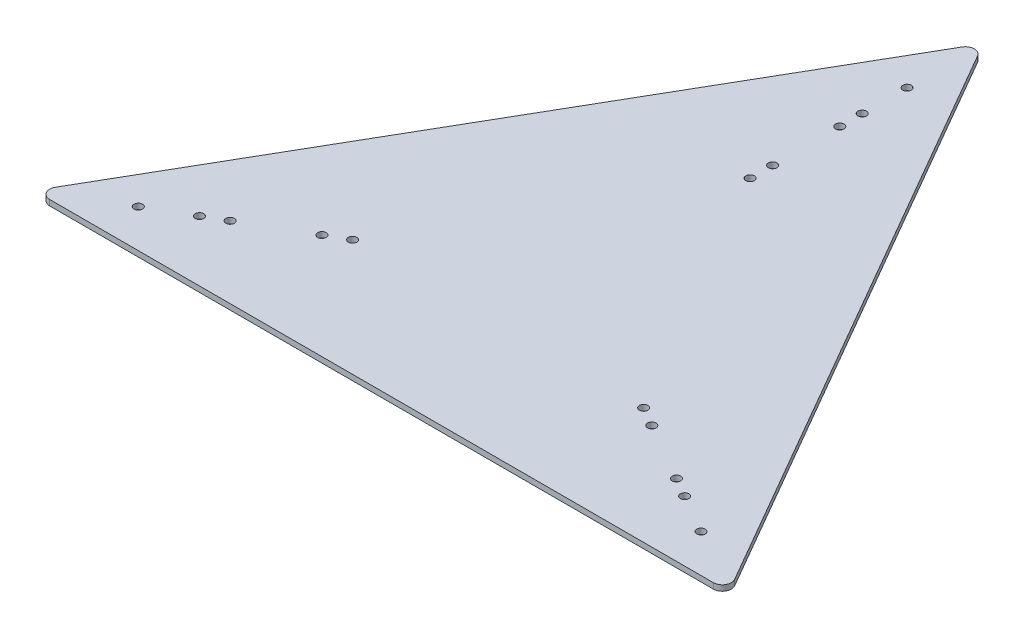
ISO-10303-21;
HEADER;
FILE_DESCRIPTION(('STEP AP214'),'2;1');
FILE_NAME('part.step','',(''),(''),'','','');
FILE_SCHEMA(('AUTOMOTIVE_DESIGN { 1 0 10303 214 1 1 1 1 }'));
ENDSEC;
DATA;
#1=APPLICATION_CONTEXT('core data for automotive mechanical design processes');
#2=APPLICATION_PROTOCOL_DEFINITION('international standard','automotive_design',2000,#1);
#3=PRODUCT_CONTEXT('',#1,'mechanical');
#4=PRODUCT('Part','Part','',(#3));
#5=PRODUCT_RELATED_PRODUCT_CATEGORY('part','',(#4));
#6=PRODUCT_DEFINITION_FORMATION('','',#4);
#7=PRODUCT_DEFINITION_CONTEXT('part definition',#1,'design');
#8=PRODUCT_DEFINITION('design','',#6,#7);
#9=PRODUCT_DEFINITION_SHAPE('','',#8);
#10=(LENGTH_UNIT() NAMED_UNIT(*) SI_UNIT(.MILLI.,.METRE.));
#11=(NAMED_UNIT(*) PLANE_ANGLE_UNIT() SI_UNIT($,.RADIAN.));
#12=(NAMED_UNIT(*) SI_UNIT($,.STERADIAN.) SOLID_ANGLE_UNIT());
#13=UNCERTAINTY_MEASURE_WITH_UNIT(LENGTH_MEASURE(1.E-05),#10,'distance_accuracy_value','');
#14=(GEOMETRIC_REPRESENTATION_CONTEXT(3) GLOBAL_UNCERTAINTY_ASSIGNED_CONTEXT((#13)) GLOBAL_UNIT_ASSIGNED_CONTEXT((#10,
#11,#12)) REPRESENTATION_CONTEXT('',''));
#15=CARTESIAN_POINT('',(0.,0.,0.));
#16=DIRECTION('',(0.,0.,1.));
#17=DIRECTION('',(1.,0.,0.));
#18=AXIS2_PLACEMENT_3D('',#15,#16,#17);
#19=CARTESIAN_POINT('',(196.85,3.175,-340.954201469933));
#20=DIRECTION('',(0.866025403784439,0.,0.5));
#21=DIRECTION('',(0.5,0.,-0.866025403784439));
#22=AXIS2_PLACEMENT_3D('',#19,#20,#21);
#23=PLANE('',#22);
#24=DIRECTION('',(-0.5,0.,0.866025403784439));
#25=VECTOR('',#24,1.);
#26=CARTESIAN_POINT('',(196.85,3.175,-340.954201469933));
#27=LINE('',#26,#25);
#28=CARTESIAN_POINT('',(192.450590948775,3.175,-333.334201469933));
#29=VERTEX_POINT('',#28);
#30=CARTESIAN_POINT('',(4.39940905122493,3.175,-7.61999999999996));
#31=VERTEX_POINT('',#30);
#32=EDGE_CURVE('E105',#29,#31,#27,.T.);
#33=ORIENTED_EDGE('',*,*,#32,.F.);
#34=DIRECTION('',(0.,-1.,0.));
#35=VECTOR('',#34,1.);
#36=CARTESIAN_POINT('',(192.450590948775,3.175,-333.334201469933));
#37=LINE('',#36,#35);
#38=CARTESIAN_POINT('',(192.450590948775,0.,-333.334201469933));
#39=VERTEX_POINT('',#38);
#40=EDGE_CURVE('E91',#29,#39,#37,.T.);
#41=ORIENTED_EDGE('',*,*,#40,.T.);
#42=DIRECTION('',(-0.5,0.,0.866025403784439));
#43=VECTOR('',#42,1.);
#44=CARTESIAN_POINT('',(196.85,0.,-340.954201469933));
#45=LINE('',#44,#43);
#46=CARTESIAN_POINT('',(4.39940905122493,0.,-7.61999999999996));
#47=VERTEX_POINT('',#46);
#48=EDGE_CURVE('E103',#39,#47,#45,.T.);
#49=ORIENTED_EDGE('',*,*,#48,.T.);
#50=DIRECTION('',(0.,-1.,0.));
#51=VECTOR('',#50,1.);
#52=CARTESIAN_POINT('',(4.39940905122499,3.175,-7.62000000000002));
#53=LINE('',#52,#51);
#54=EDGE_CURVE('E107',#47,#31,#53,.F.);
#55=ORIENTED_EDGE('',*,*,#54,.T.);
#56=EDGE_LOOP('',(#33,#41,#49,#55));
#57=FACE_BOUND('',#56,.T.);
#58=ADVANCED_FACE('F34',(#57),#23,.F.);
#59=CARTESIAN_POINT('',(0.,3.175,0.));
#60=DIRECTION('',(0.,0.,-1.));
#61=DIRECTION('',(-1.,0.,0.));
#62=AXIS2_PLACEMENT_3D('',#59,#60,#61);
#63=PLANE('',#62);
#64=DIRECTION('',(1.,0.,0.));
#65=VECTOR('',#64,1.);
#66=CARTESIAN_POINT('',(0.,0.,0.));
#67=LINE('',#66,#65);
#68=CARTESIAN_POINT('',(8.79881810244992,0.,0.));
#69=VERTEX_POINT('',#68);
#70=CARTESIAN_POINT('',(384.90118189755,0.,0.));
#71=VERTEX_POINT('',#70);
#72=EDGE_CURVE('E111',#69,#71,#67,.T.);
#73=ORIENTED_EDGE('',*,*,#72,.T.);
#74=DIRECTION('',(0.,-1.,0.));
#75=VECTOR('',#74,1.);
#76=CARTESIAN_POINT('',(384.90118189755,3.175,0.));
#77=LINE('',#76,#75);
#78=CARTESIAN_POINT('',(384.90118189755,3.175,0.));
#79=VERTEX_POINT('',#78);
#80=EDGE_CURVE('E11',#71,#79,#77,.F.);
#81=ORIENTED_EDGE('',*,*,#80,.T.);
#82=DIRECTION('',(1.,0.,0.));
#83=VECTOR('',#82,1.);
#84=CARTESIAN_POINT('',(0.,3.175,0.));
#85=LINE('',#84,#83);
#86=CARTESIAN_POINT('',(8.79881810244992,3.175,0.));
#87=VERTEX_POINT('',#86);
#88=EDGE_CURVE('E137',#87,#79,#85,.T.);
#89=ORIENTED_EDGE('',*,*,#88,.F.);
#90=DIRECTION('',(0.,-1.,0.));
#91=VECTOR('',#90,1.);
#92=CARTESIAN_POINT('',(8.79881810244992,3.175,0.));
#93=LINE('',#92,#91);
#94=EDGE_CURVE('E42',#87,#69,#93,.T.);
#95=ORIENTED_EDGE('',*,*,#94,.T.);
#96=EDGE_LOOP('',(#73,#81,#89,#95));
#97=FACE_BOUND('',#96,.T.);
#98=ADVANCED_FACE('F136',(#97),#63,.F.);
#99=CARTESIAN_POINT('',(393.7,3.175,0.));
#100=DIRECTION('',(-0.866025403784439,0.,0.5));
#101=DIRECTION('',(0.5,0.,0.866025403784439));
#102=AXIS2_PLACEMENT_3D('',#99,#100,#101);
#103=PLANE('',#102);
#104=DIRECTION('',(-0.5,0.,-0.866025403784439));
#105=VECTOR('',#104,1.);
#106=CARTESIAN_POINT('',(393.7,0.,0.));
#107=LINE('',#106,#105);
#108=CARTESIAN_POINT('',(389.300590948775,0.,-7.61999999999999));
#109=VERTEX_POINT('',#108);
#110=CARTESIAN_POINT('',(201.249409051225,0.,-333.334201469934));
#111=VERTEX_POINT('',#110);
#112=EDGE_CURVE('E114',#109,#111,#107,.T.);
#113=ORIENTED_EDGE('',*,*,#112,.T.);
#114=DIRECTION('',(0.,-1.,0.));
#115=VECTOR('',#114,1.);
#116=CARTESIAN_POINT('',(201.249409051225,3.175,-333.334201469933));
#117=LINE('',#116,#115);
#118=CARTESIAN_POINT('',(201.249409051225,3.175,-333.334201469934));
#119=VERTEX_POINT('',#118);
#120=EDGE_CURVE('E92',#111,#119,#117,.F.);
#121=ORIENTED_EDGE('',*,*,#120,.T.);
#122=DIRECTION('',(-0.5,0.,-0.866025403784439));
#123=VECTOR('',#122,1.);
#124=CARTESIAN_POINT('',(393.7,3.175,0.));
#125=LINE('',#124,#123);
#126=CARTESIAN_POINT('',(389.300590948775,3.175,-7.61999999999999));
#127=VERTEX_POINT('',#126);
#128=EDGE_CURVE('E120',#127,#119,#125,.T.);
#129=ORIENTED_EDGE('',*,*,#128,.F.);
#130=DIRECTION('',(0.,-1.,0.));
#131=VECTOR('',#130,1.);
#132=CARTESIAN_POINT('',(389.300590948775,3.175,-7.61999999999999));
#133=LINE('',#132,#131);
#134=EDGE_CURVE('E97',#127,#109,#133,.T.);
#135=ORIENTED_EDGE('',*,*,#134,.T.);
#136=EDGE_LOOP('',(#113,#121,#129,#135));
#137=FACE_BOUND('',#136,.T.);
#138=ADVANCED_FACE('F145',(#137),#103,.F.);
#139=CARTESIAN_POINT('',(0.,3.175,0.));
#140=DIRECTION('',(0.,1.,0.));
#141=DIRECTION('',(0.,0.,1.));
#142=AXIS2_PLACEMENT_3D('',#139,#140,#141);
#143=PLANE('',#142);
#144=CARTESIAN_POINT('',(37.3949769354121,3.175,-21.59));
#145=DIRECTION('',(0.,1.,0.));
#146=DIRECTION('',(0.,0.,1.));
#147=AXIS2_PLACEMENT_3D('',#144,#145,#146);
#148=CIRCLE('',#147,2.413);
#149=CARTESIAN_POINT('',(37.3949769354121,3.175,-19.177));
#150=VERTEX_POINT('',#149);
#151=EDGE_CURVE('E117',#150,#150,#148,.T.);
#152=ORIENTED_EDGE('',*,*,#151,.F.);
#153=EDGE_LOOP('',(#152));
#154=FACE_BOUND('',#153,.T.);
#155=CARTESIAN_POINT('',(356.305023064588,3.175,-21.5900000000001));
#156=DIRECTION('',(0.,1.,0.));
#157=DIRECTION('',(0.,0.,-1.));
#158=AXIS2_PLACEMENT_3D('',#155,#156,#157);
#159=CIRCLE('',#158,2.413);
#160=CARTESIAN_POINT('',(356.305023064588,3.175,-24.003));
#161=VERTEX_POINT('',#160);
#162=EDGE_CURVE('E202',#161,#161,#159,.T.);
#163=ORIENTED_EDGE('',*,*,#162,.F.);
#164=EDGE_LOOP('',(#163));
#165=FACE_BOUND('',#164,.T.);
#166=CARTESIAN_POINT('',(334.307977808463,3.175,-34.29));
#167=DIRECTION('',(0.,1.,0.));
#168=DIRECTION('',(0.,0.,-1.));
#169=AXIS2_PLACEMENT_3D('',#166,#167,#168);
#170=CIRCLE('',#169,2.41299999999999);
#171=CARTESIAN_POINT('',(334.307977808463,3.175,-36.703));
#172=VERTEX_POINT('',#171);
#173=EDGE_CURVE('E201',#172,#172,#170,.T.);
#174=ORIENTED_EDGE('',*,*,#173,.F.);
#175=EDGE_LOOP('',(#174));
#176=FACE_BOUND('',#175,.T.);
#177=CARTESIAN_POINT('',(323.309455180401,3.175,-40.64));
#178=DIRECTION('',(0.,1.,0.));
#179=DIRECTION('',(0.,0.,-1.));
#180=AXIS2_PLACEMENT_3D('',#177,#178,#179);
#181=CIRCLE('',#180,2.41299999999999);
#182=CARTESIAN_POINT('',(323.309455180401,3.175,-43.053));
#183=VERTEX_POINT('',#182);
#184=EDGE_CURVE('E208',#183,#183,#181,.T.);
#185=ORIENTED_EDGE('',*,*,#184,.F.);
#186=EDGE_LOOP('',(#185));
#187=FACE_BOUND('',#186,.T.);
#188=CARTESIAN_POINT('',(290.313887296214,3.175,-59.69));
#189=DIRECTION('',(0.,1.,0.));
#190=DIRECTION('',(0.,0.,-1.));
#191=AXIS2_PLACEMENT_3D('',#188,#189,#190);
#192=CIRCLE('',#191,2.41299999999999);
#193=CARTESIAN_POINT('',(290.313887296214,3.175,-62.103));
#194=VERTEX_POINT('',#193);
#195=EDGE_CURVE('E214',#194,#194,#192,.T.);
#196=ORIENTED_EDGE('',*,*,#195,.F.);
#197=EDGE_LOOP('',(#196));
#198=FACE_BOUND('',#197,.T.);
#199=CARTESIAN_POINT('',(279.315364668152,3.175,-66.04));
#200=DIRECTION('',(0.,1.,0.));
#201=DIRECTION('',(0.,0.,-1.));
#202=AXIS2_PLACEMENT_3D('',#199,#200,#201);
#203=CIRCLE('',#202,2.41299999999999);
#204=CARTESIAN_POINT('',(279.315364668152,3.175,-68.453));
#205=VERTEX_POINT('',#204);
#206=EDGE_CURVE('E220',#205,#205,#203,.T.);
#207=ORIENTED_EDGE('',*,*,#206,.F.);
#208=EDGE_LOOP('',(#207));
#209=FACE_BOUND('',#208,.T.);
#210=CARTESIAN_POINT('',(196.85,3.175,-208.874201469934));
#211=DIRECTION('',(0.,1.,0.));
#212=DIRECTION('',(0.,0.,1.));
#213=AXIS2_PLACEMENT_3D('',#210,#211,#212);
#214=CIRCLE('',#213,2.413);
#215=CARTESIAN_POINT('',(196.85,3.175,-206.461201469934));
#216=VERTEX_POINT('',#215);
#217=EDGE_CURVE('E226',#216,#216,#214,.T.);
#218=ORIENTED_EDGE('',*,*,#217,.F.);
#219=EDGE_LOOP('',(#218));
#220=FACE_BOUND('',#219,.T.);
#221=CARTESIAN_POINT('',(196.85,3.175,-221.574201469934));
#222=DIRECTION('',(0.,1.,0.));
#223=DIRECTION('',(0.,0.,1.));
#224=AXIS2_PLACEMENT_3D('',#221,#222,#223);
#225=CIRCLE('',#224,2.413);
#226=CARTESIAN_POINT('',(196.85,3.175,-219.161201469934));
#227=VERTEX_POINT('',#226);
#228=EDGE_CURVE('E153',#227,#227,#225,.T.);
#229=ORIENTED_EDGE('',*,*,#228,.F.);
#230=EDGE_LOOP('',(#229));
#231=FACE_BOUND('',#230,.T.);
#232=CARTESIAN_POINT('',(196.85,3.175,-259.674201469934));
#233=DIRECTION('',(0.,1.,0.));
#234=DIRECTION('',(0.,0.,1.));
#235=AXIS2_PLACEMENT_3D('',#232,#233,#234);
#236=CIRCLE('',#235,2.413);
#237=CARTESIAN_POINT('',(196.85,3.175,-257.261201469934));
#238=VERTEX_POINT('',#237);
#239=EDGE_CURVE('E152',#238,#238,#236,.T.);
#240=ORIENTED_EDGE('',*,*,#239,.F.);
#241=EDGE_LOOP('',(#240));
#242=FACE_BOUND('',#241,.T.);
#243=CARTESIAN_POINT('',(196.85,3.175,-272.374201469934));
#244=DIRECTION('',(0.,1.,0.));
#245=DIRECTION('',(0.,0.,1.));
#246=AXIS2_PLACEMENT_3D('',#243,#244,#245);
#247=CIRCLE('',#246,2.413);
#248=CARTESIAN_POINT('',(196.85,3.175,-269.961201469934));
#249=VERTEX_POINT('',#248);
#250=EDGE_CURVE('E160',#249,#249,#247,.T.);
#251=ORIENTED_EDGE('',*,*,#250,.F.);
#252=EDGE_LOOP('',(#251));
#253=FACE_BOUND('',#252,.T.);
#254=CARTESIAN_POINT('',(196.85,3.175,-297.774201469934));
#255=DIRECTION('',(0.,1.,0.));
#256=DIRECTION('',(0.,0.,1.));
#257=AXIS2_PLACEMENT_3D('',#254,#255,#256);
#258=CIRCLE('',#257,2.413);
#259=CARTESIAN_POINT('',(196.85,3.175,-295.361201469934));
#260=VERTEX_POINT('',#259);
#261=EDGE_CURVE('E166',#260,#260,#258,.T.);
#262=ORIENTED_EDGE('',*,*,#261,.F.);
#263=EDGE_LOOP('',(#262));
#264=FACE_BOUND('',#263,.T.);
#265=CARTESIAN_POINT('',(103.386112703786,3.175,-59.69));
#266=DIRECTION('',(0.,1.,0.));
#267=DIRECTION('',(0.,0.,1.));
#268=AXIS2_PLACEMENT_3D('',#265,#266,#267);
#269=CIRCLE('',#268,2.41299999999999);
#270=CARTESIAN_POINT('',(103.386112703786,3.175,-57.277));
#271=VERTEX_POINT('',#270);
#272=EDGE_CURVE('E172',#271,#271,#269,.T.);
#273=ORIENTED_EDGE('',*,*,#272,.F.);
#274=EDGE_LOOP('',(#273));
#275=FACE_BOUND('',#274,.T.);
#276=CARTESIAN_POINT('',(114.384635331849,3.175,-66.04));
#277=DIRECTION('',(0.,1.,0.));
#278=DIRECTION('',(0.,0.,1.));
#279=AXIS2_PLACEMENT_3D('',#276,#277,#278);
#280=CIRCLE('',#279,2.41299999999999);
#281=CARTESIAN_POINT('',(114.384635331849,3.175,-63.627));
#282=VERTEX_POINT('',#281);
#283=EDGE_CURVE('E178',#282,#282,#280,.T.);
#284=ORIENTED_EDGE('',*,*,#283,.F.);
#285=EDGE_LOOP('',(#284));
#286=FACE_BOUND('',#285,.T.);
#287=CARTESIAN_POINT('',(70.3905448195992,3.175,-40.64));
#288=DIRECTION('',(0.,1.,0.));
#289=DIRECTION('',(0.,0.,1.));
#290=AXIS2_PLACEMENT_3D('',#287,#288,#289);
#291=CIRCLE('',#290,2.41299999999999);
#292=CARTESIAN_POINT('',(70.3905448195992,3.175,-38.227));
#293=VERTEX_POINT('',#292);
#294=EDGE_CURVE('E184',#293,#293,#291,.T.);
#295=ORIENTED_EDGE('',*,*,#294,.F.);
#296=EDGE_LOOP('',(#295));
#297=FACE_BOUND('',#296,.T.);
#298=CARTESIAN_POINT('',(59.3920221915368,3.175,-34.29));
#299=DIRECTION('',(0.,1.,0.));
#300=DIRECTION('',(0.,0.,1.));
#301=AXIS2_PLACEMENT_3D('',#298,#299,#300);
#302=CIRCLE('',#301,2.41299999999999);
#303=CARTESIAN_POINT('',(59.3920221915368,3.175,-31.877));
#304=VERTEX_POINT('',#303);
#305=EDGE_CURVE('E190',#304,#304,#302,.T.);
#306=ORIENTED_EDGE('',*,*,#305,.F.);
#307=EDGE_LOOP('',(#306));
#308=FACE_BOUND('',#307,.T.);
#309=ORIENTED_EDGE('',*,*,#128,.T.);
#310=CARTESIAN_POINT('',(196.85,3.175,-330.794201469934));
#311=DIRECTION('',(0.,1.,0.));
#312=DIRECTION('',(0.,0.,1.));
#313=AXIS2_PLACEMENT_3D('',#310,#311,#312);
#314=CIRCLE('',#313,5.08);
#315=EDGE_CURVE('E133',#119,#29,#314,.T.);
#316=ORIENTED_EDGE('',*,*,#315,.T.);
#317=ORIENTED_EDGE('',*,*,#32,.T.);
#318=CARTESIAN_POINT('',(8.79881810244992,3.175,-5.08));
#319=DIRECTION('',(0.,1.,0.));
#320=DIRECTION('',(0.,0.,1.));
#321=AXIS2_PLACEMENT_3D('',#318,#319,#320);
#322=CIRCLE('',#321,5.08);
#323=EDGE_CURVE('E54',#31,#87,#322,.T.);
#324=ORIENTED_EDGE('',*,*,#323,.T.);
#325=ORIENTED_EDGE('',*,*,#88,.T.);
#326=CARTESIAN_POINT('',(384.90118189755,3.175,-5.08));
#327=DIRECTION('',(0.,1.,0.));
#328=DIRECTION('',(0.,0.,1.));
#329=AXIS2_PLACEMENT_3D('',#326,#327,#328);
#330=CIRCLE('',#329,5.08);
#331=EDGE_CURVE('E131',#79,#127,#330,.T.);
#332=ORIENTED_EDGE('',*,*,#331,.T.);
#333=EDGE_LOOP('',(#309,#316,#317,#324,#325,#332));
#334=FACE_BOUND('',#333,.T.);
#335=ADVANCED_FACE('F238',(#154,#165,#176,#187,#198,#209,#220,#231,#242,#253,#264,#275,#286,
#297,#308,#334),#143,.T.);
#336=CARTESIAN_POINT('',(0.,0.,0.));
#337=DIRECTION('',(0.,1.,0.));
#338=DIRECTION('',(0.,0.,1.));
#339=AXIS2_PLACEMENT_3D('',#336,#337,#338);
#340=PLANE('',#339);
#341=CARTESIAN_POINT('',(37.3949769354121,0.,-21.59));
#342=DIRECTION('',(0.,1.,0.));
#343=DIRECTION('',(0.,0.,1.));
#344=AXIS2_PLACEMENT_3D('',#341,#342,#343);
#345=CIRCLE('',#344,2.413);
#346=CARTESIAN_POINT('',(37.3949769354121,0.,-19.177));
#347=VERTEX_POINT('',#346);
#348=EDGE_CURVE('E112',#347,#347,#345,.F.);
#349=ORIENTED_EDGE('',*,*,#348,.F.);
#350=EDGE_LOOP('',(#349));
#351=FACE_BOUND('',#350,.T.);
#352=CARTESIAN_POINT('',(356.305023064588,0.,-21.5900000000001));
#353=DIRECTION('',(0.,1.,0.));
#354=DIRECTION('',(0.,0.,1.));
#355=AXIS2_PLACEMENT_3D('',#352,#353,#354);
#356=CIRCLE('',#355,2.413);
#357=CARTESIAN_POINT('',(356.305023064588,0.,-19.1770000000001));
#358=VERTEX_POINT('',#357);
#359=EDGE_CURVE('E198',#358,#358,#356,.F.);
#360=ORIENTED_EDGE('',*,*,#359,.F.);
#361=EDGE_LOOP('',(#360));
#362=FACE_BOUND('',#361,.T.);
#363=CARTESIAN_POINT('',(334.307977808463,0.,-34.29));
#364=DIRECTION('',(0.,1.,0.));
#365=DIRECTION('',(0.,0.,1.));
#366=AXIS2_PLACEMENT_3D('',#363,#364,#365);
#367=CIRCLE('',#366,2.41299999999999);
#368=CARTESIAN_POINT('',(334.307977808463,0.,-31.8770000000001));
#369=VERTEX_POINT('',#368);
#370=EDGE_CURVE('E205',#369,#369,#367,.F.);
#371=ORIENTED_EDGE('',*,*,#370,.F.);
#372=EDGE_LOOP('',(#371));
#373=FACE_BOUND('',#372,.T.);
#374=CARTESIAN_POINT('',(323.309455180401,0.,-40.64));
#375=DIRECTION('',(0.,1.,0.));
#376=DIRECTION('',(0.,0.,1.));
#377=AXIS2_PLACEMENT_3D('',#374,#375,#376);
#378=CIRCLE('',#377,2.41299999999999);
#379=CARTESIAN_POINT('',(323.309455180401,0.,-38.227));
#380=VERTEX_POINT('',#379);
#381=EDGE_CURVE('E211',#380,#380,#378,.F.);
#382=ORIENTED_EDGE('',*,*,#381,.F.);
#383=EDGE_LOOP('',(#382));
#384=FACE_BOUND('',#383,.T.);
#385=CARTESIAN_POINT('',(290.313887296214,0.,-59.69));
#386=DIRECTION('',(0.,1.,0.));
#387=DIRECTION('',(0.,0.,1.));
#388=AXIS2_PLACEMENT_3D('',#385,#386,#387);
#389=CIRCLE('',#388,2.41299999999999);
#390=CARTESIAN_POINT('',(290.313887296214,0.,-57.277));
#391=VERTEX_POINT('',#390);
#392=EDGE_CURVE('E217',#391,#391,#389,.F.);
#393=ORIENTED_EDGE('',*,*,#392,.F.);
#394=EDGE_LOOP('',(#393));
#395=FACE_BOUND('',#394,.T.);
#396=CARTESIAN_POINT('',(279.315364668152,0.,-66.04));
#397=DIRECTION('',(0.,1.,0.));
#398=DIRECTION('',(0.,0.,1.));
#399=AXIS2_PLACEMENT_3D('',#396,#397,#398);
#400=CIRCLE('',#399,2.41299999999999);
#401=CARTESIAN_POINT('',(279.315364668152,0.,-63.627));
#402=VERTEX_POINT('',#401);
#403=EDGE_CURVE('E223',#402,#402,#400,.F.);
#404=ORIENTED_EDGE('',*,*,#403,.F.);
#405=EDGE_LOOP('',(#404));
#406=FACE_BOUND('',#405,.T.);
#407=CARTESIAN_POINT('',(196.85,0.,-208.874201469934));
#408=DIRECTION('',(0.,1.,0.));
#409=DIRECTION('',(0.,0.,1.));
#410=AXIS2_PLACEMENT_3D('',#407,#408,#409);
#411=CIRCLE('',#410,2.413);
#412=CARTESIAN_POINT('',(196.85,0.,-206.461201469934));
#413=VERTEX_POINT('',#412);
#414=EDGE_CURVE('E156',#413,#413,#411,.F.);
#415=ORIENTED_EDGE('',*,*,#414,.F.);
#416=EDGE_LOOP('',(#415));
#417=FACE_BOUND('',#416,.T.);
#418=CARTESIAN_POINT('',(196.85,0.,-221.574201469934));
#419=DIRECTION('',(0.,1.,0.));
#420=DIRECTION('',(0.,0.,1.));
#421=AXIS2_PLACEMENT_3D('',#418,#419,#420);
#422=CIRCLE('',#421,2.413);
#423=CARTESIAN_POINT('',(196.85,0.,-219.161201469934));
#424=VERTEX_POINT('',#423);
#425=EDGE_CURVE('E149',#424,#424,#422,.F.);
#426=ORIENTED_EDGE('',*,*,#425,.F.);
#427=EDGE_LOOP('',(#426));
#428=FACE_BOUND('',#427,.T.);
#429=CARTESIAN_POINT('',(196.85,0.,-259.674201469934));
#430=DIRECTION('',(0.,1.,0.));
#431=DIRECTION('',(0.,0.,1.));
#432=AXIS2_PLACEMENT_3D('',#429,#430,#431);
#433=CIRCLE('',#432,2.413);
#434=CARTESIAN_POINT('',(196.85,0.,-257.261201469934));
#435=VERTEX_POINT('',#434);
#436=EDGE_CURVE('E157',#435,#435,#433,.F.);
#437=ORIENTED_EDGE('',*,*,#436,.F.);
#438=EDGE_LOOP('',(#437));
#439=FACE_BOUND('',#438,.T.);
#440=CARTESIAN_POINT('',(196.85,0.,-272.374201469934));
#441=DIRECTION('',(0.,1.,0.));
#442=DIRECTION('',(0.,0.,1.));
#443=AXIS2_PLACEMENT_3D('',#440,#441,#442);
#444=CIRCLE('',#443,2.413);
#445=CARTESIAN_POINT('',(196.85,0.,-269.961201469934));
#446=VERTEX_POINT('',#445);
#447=EDGE_CURVE('E163',#446,#446,#444,.F.);
#448=ORIENTED_EDGE('',*,*,#447,.F.);
#449=EDGE_LOOP('',(#448));
#450=FACE_BOUND('',#449,.T.);
#451=CARTESIAN_POINT('',(196.85,0.,-297.774201469934));
#452=DIRECTION('',(0.,1.,0.));
#453=DIRECTION('',(0.,0.,1.));
#454=AXIS2_PLACEMENT_3D('',#451,#452,#453);
#455=CIRCLE('',#454,2.413);
#456=CARTESIAN_POINT('',(196.85,0.,-295.361201469934));
#457=VERTEX_POINT('',#456);
#458=EDGE_CURVE('E169',#457,#457,#455,.F.);
#459=ORIENTED_EDGE('',*,*,#458,.F.);
#460=EDGE_LOOP('',(#459));
#461=FACE_BOUND('',#460,.T.);
#462=CARTESIAN_POINT('',(103.386112703786,0.,-59.69));
#463=DIRECTION('',(0.,1.,0.));
#464=DIRECTION('',(0.,0.,1.));
#465=AXIS2_PLACEMENT_3D('',#462,#463,#464);
#466=CIRCLE('',#465,2.41299999999999);
#467=CARTESIAN_POINT('',(103.386112703786,0.,-57.277));
#468=VERTEX_POINT('',#467);
#469=EDGE_CURVE('E175',#468,#468,#466,.F.);
#470=ORIENTED_EDGE('',*,*,#469,.F.);
#471=EDGE_LOOP('',(#470));
#472=FACE_BOUND('',#471,.T.);
#473=CARTESIAN_POINT('',(114.384635331849,0.,-66.04));
#474=DIRECTION('',(0.,1.,0.));
#475=DIRECTION('',(0.,0.,1.));
#476=AXIS2_PLACEMENT_3D('',#473,#474,#475);
#477=CIRCLE('',#476,2.41299999999999);
#478=CARTESIAN_POINT('',(114.384635331849,0.,-63.627));
#479=VERTEX_POINT('',#478);
#480=EDGE_CURVE('E181',#479,#479,#477,.F.);
#481=ORIENTED_EDGE('',*,*,#480,.F.);
#482=EDGE_LOOP('',(#481));
#483=FACE_BOUND('',#482,.T.);
#484=CARTESIAN_POINT('',(70.3905448195992,0.,-40.64));
#485=DIRECTION('',(0.,1.,0.));
#486=DIRECTION('',(0.,0.,1.));
#487=AXIS2_PLACEMENT_3D('',#484,#485,#486);
#488=CIRCLE('',#487,2.41299999999999);
#489=CARTESIAN_POINT('',(70.3905448195992,0.,-38.227));
#490=VERTEX_POINT('',#489);
#491=EDGE_CURVE('E187',#490,#490,#488,.F.);
#492=ORIENTED_EDGE('',*,*,#491,.F.);
#493=EDGE_LOOP('',(#492));
#494=FACE_BOUND('',#493,.T.);
#495=CARTESIAN_POINT('',(59.3920221915368,0.,-34.29));
#496=DIRECTION('',(0.,1.,0.));
#497=DIRECTION('',(0.,0.,1.));
#498=AXIS2_PLACEMENT_3D('',#495,#496,#497);
#499=CIRCLE('',#498,2.41299999999999);
#500=CARTESIAN_POINT('',(59.3920221915368,0.,-31.877));
#501=VERTEX_POINT('',#500);
#502=EDGE_CURVE('E193',#501,#501,#499,.F.);
#503=ORIENTED_EDGE('',*,*,#502,.F.);
#504=EDGE_LOOP('',(#503));
#505=FACE_BOUND('',#504,.T.);
#506=ORIENTED_EDGE('',*,*,#48,.F.);
#507=CARTESIAN_POINT('',(196.85,0.,-330.794201469934));
#508=DIRECTION('',(0.,1.,0.));
#509=DIRECTION('',(0.,0.,1.));
#510=AXIS2_PLACEMENT_3D('',#507,#508,#509);
#511=CIRCLE('',#510,5.08);
#512=EDGE_CURVE('E87',#39,#111,#511,.F.);
#513=ORIENTED_EDGE('',*,*,#512,.T.);
#514=ORIENTED_EDGE('',*,*,#112,.F.);
#515=CARTESIAN_POINT('',(384.90118189755,0.,-5.08));
#516=DIRECTION('',(0.,1.,0.));
#517=DIRECTION('',(0.,0.,1.));
#518=AXIS2_PLACEMENT_3D('',#515,#516,#517);
#519=CIRCLE('',#518,5.08);
#520=EDGE_CURVE('E98',#109,#71,#519,.F.);
#521=ORIENTED_EDGE('',*,*,#520,.T.);
#522=ORIENTED_EDGE('',*,*,#72,.F.);
#523=CARTESIAN_POINT('',(8.79881810244992,0.,-5.08));
#524=DIRECTION('',(0.,1.,0.));
#525=DIRECTION('',(0.,0.,1.));
#526=AXIS2_PLACEMENT_3D('',#523,#524,#525);
#527=CIRCLE('',#526,5.08);
#528=EDGE_CURVE('E106',#69,#47,#527,.F.);
#529=ORIENTED_EDGE('',*,*,#528,.T.);
#530=EDGE_LOOP('',(#506,#513,#514,#521,#522,#529));
#531=FACE_BOUND('',#530,.T.);
#532=ADVANCED_FACE('F109',(#351,#362,#373,#384,#395,#406,#417,#428,#439,#450,#461,#472,#483,
#494,#505,#531),#340,.F.);
#533=CARTESIAN_POINT('',(196.85,3.175,-330.794201469934));
#534=DIRECTION('',(0.,-1.,0.));
#535=DIRECTION('',(0.,0.,-1.));
#536=AXIS2_PLACEMENT_3D('',#533,#534,#535);
#537=CYLINDRICAL_SURFACE('',#536,5.08);
#538=ORIENTED_EDGE('',*,*,#315,.F.);
#539=ORIENTED_EDGE('',*,*,#120,.F.);
#540=ORIENTED_EDGE('',*,*,#512,.F.);
#541=ORIENTED_EDGE('',*,*,#40,.F.);
#542=EDGE_LOOP('',(#538,#539,#540,#541));
#543=FACE_BOUND('',#542,.T.);
#544=ADVANCED_FACE('F90',(#543),#537,.T.);
#545=CARTESIAN_POINT('',(384.90118189755,3.175,-5.08));
#546=DIRECTION('',(0.,-1.,0.));
#547=DIRECTION('',(0.,0.,-1.));
#548=AXIS2_PLACEMENT_3D('',#545,#546,#547);
#549=CYLINDRICAL_SURFACE('',#548,5.08);
#550=ORIENTED_EDGE('',*,*,#331,.F.);
#551=ORIENTED_EDGE('',*,*,#80,.F.);
#552=ORIENTED_EDGE('',*,*,#520,.F.);
#553=ORIENTED_EDGE('',*,*,#134,.F.);
#554=EDGE_LOOP('',(#550,#551,#552,#553));
#555=FACE_BOUND('',#554,.T.);
#556=ADVANCED_FACE('F142',(#555),#549,.T.);
#557=CARTESIAN_POINT('',(8.79881810244992,3.175,-5.08));
#558=DIRECTION('',(0.,-1.,0.));
#559=DIRECTION('',(0.,0.,-1.));
#560=AXIS2_PLACEMENT_3D('',#557,#558,#559);
#561=CYLINDRICAL_SURFACE('',#560,5.08);
#562=ORIENTED_EDGE('',*,*,#323,.F.);
#563=ORIENTED_EDGE('',*,*,#54,.F.);
#564=ORIENTED_EDGE('',*,*,#528,.F.);
#565=ORIENTED_EDGE('',*,*,#94,.F.);
#566=EDGE_LOOP('',(#562,#563,#564,#565));
#567=FACE_BOUND('',#566,.T.);
#568=ADVANCED_FACE('F36',(#567),#561,.T.);
#569=CARTESIAN_POINT('',(59.3920221915368,-6.82499465201255,-34.29));
#570=DIRECTION('',(0.,1.,0.));
#571=DIRECTION('',(0.,0.,1.));
#572=AXIS2_PLACEMENT_3D('',#569,#570,#571);
#573=CYLINDRICAL_SURFACE('',#572,2.41299999999999);
#574=ORIENTED_EDGE('',*,*,#502,.T.);
#575=EDGE_LOOP('',(#574));
#576=FACE_BOUND('',#575,.T.);
#577=ORIENTED_EDGE('',*,*,#305,.T.);
#578=EDGE_LOOP('',(#577));
#579=FACE_BOUND('',#578,.T.);
#580=ADVANCED_FACE('F270',(#576,#579),#573,.F.);
#581=CARTESIAN_POINT('',(70.3905448195992,-6.82499465201255,-40.64));
#582=DIRECTION('',(0.,1.,0.));
#583=DIRECTION('',(0.,0.,1.));
#584=AXIS2_PLACEMENT_3D('',#581,#582,#583);
#585=CYLINDRICAL_SURFACE('',#584,2.41299999999999);
#586=ORIENTED_EDGE('',*,*,#491,.T.);
#587=EDGE_LOOP('',(#586));
#588=FACE_BOUND('',#587,.T.);
#589=ORIENTED_EDGE('',*,*,#294,.T.);
#590=EDGE_LOOP('',(#589));
#591=FACE_BOUND('',#590,.T.);
#592=ADVANCED_FACE('F272',(#588,#591),#585,.F.);
#593=CARTESIAN_POINT('',(114.384635331849,-6.82499465201255,-66.04));
#594=DIRECTION('',(0.,1.,0.));
#595=DIRECTION('',(0.,0.,1.));
#596=AXIS2_PLACEMENT_3D('',#593,#594,#595);
#597=CYLINDRICAL_SURFACE('',#596,2.41299999999999);
#598=ORIENTED_EDGE('',*,*,#480,.T.);
#599=EDGE_LOOP('',(#598));
#600=FACE_BOUND('',#599,.T.);
#601=ORIENTED_EDGE('',*,*,#283,.T.);
#602=EDGE_LOOP('',(#601));
#603=FACE_BOUND('',#602,.T.);
#604=ADVANCED_FACE('F279',(#600,#603),#597,.F.);
#605=CARTESIAN_POINT('',(103.386112703786,-6.82499465201255,-59.69));
#606=DIRECTION('',(0.,1.,0.));
#607=DIRECTION('',(0.,0.,1.));
#608=AXIS2_PLACEMENT_3D('',#605,#606,#607);
#609=CYLINDRICAL_SURFACE('',#608,2.41299999999999);
#610=ORIENTED_EDGE('',*,*,#469,.T.);
#611=EDGE_LOOP('',(#610));
#612=FACE_BOUND('',#611,.T.);
#613=ORIENTED_EDGE('',*,*,#272,.T.);
#614=EDGE_LOOP('',(#613));
#615=FACE_BOUND('',#614,.T.);
#616=ADVANCED_FACE('F315',(#612,#615),#609,.F.);
#617=CARTESIAN_POINT('',(196.85,-6.82499465201255,-297.774201469934));
#618=DIRECTION('',(0.,1.,0.));
#619=DIRECTION('',(0.,0.,1.));
#620=AXIS2_PLACEMENT_3D('',#617,#618,#619);
#621=CYLINDRICAL_SURFACE('',#620,2.413);
#622=ORIENTED_EDGE('',*,*,#458,.T.);
#623=EDGE_LOOP('',(#622));
#624=FACE_BOUND('',#623,.T.);
#625=ORIENTED_EDGE('',*,*,#261,.T.);
#626=EDGE_LOOP('',(#625));
#627=FACE_BOUND('',#626,.T.);
#628=ADVANCED_FACE('F323',(#624,#627),#621,.F.);
#629=CARTESIAN_POINT('',(196.85,-6.82499465201255,-272.374201469934));
#630=DIRECTION('',(0.,1.,0.));
#631=DIRECTION('',(0.,0.,1.));
#632=AXIS2_PLACEMENT_3D('',#629,#630,#631);
#633=CYLINDRICAL_SURFACE('',#632,2.413);
#634=ORIENTED_EDGE('',*,*,#447,.T.);
#635=EDGE_LOOP('',(#634));
#636=FACE_BOUND('',#635,.T.);
#637=ORIENTED_EDGE('',*,*,#250,.T.);
#638=EDGE_LOOP('',(#637));
#639=FACE_BOUND('',#638,.T.);
#640=ADVANCED_FACE('F331',(#636,#639),#633,.F.);
#641=CARTESIAN_POINT('',(196.85,-6.82499465201255,-259.674201469934));
#642=DIRECTION('',(0.,1.,0.));
#643=DIRECTION('',(0.,0.,1.));
#644=AXIS2_PLACEMENT_3D('',#641,#642,#643);
#645=CYLINDRICAL_SURFACE('',#644,2.413);
#646=ORIENTED_EDGE('',*,*,#436,.T.);
#647=EDGE_LOOP('',(#646));
#648=FACE_BOUND('',#647,.T.);
#649=ORIENTED_EDGE('',*,*,#239,.T.);
#650=EDGE_LOOP('',(#649));
#651=FACE_BOUND('',#650,.T.);
#652=ADVANCED_FACE('F339',(#648,#651),#645,.F.);
#653=CARTESIAN_POINT('',(196.85,-6.82499465201255,-221.574201469934));
#654=DIRECTION('',(0.,1.,0.));
#655=DIRECTION('',(0.,0.,1.));
#656=AXIS2_PLACEMENT_3D('',#653,#654,#655);
#657=CYLINDRICAL_SURFACE('',#656,2.413);
#658=ORIENTED_EDGE('',*,*,#425,.T.);
#659=EDGE_LOOP('',(#658));
#660=FACE_BOUND('',#659,.T.);
#661=ORIENTED_EDGE('',*,*,#228,.T.);
#662=EDGE_LOOP('',(#661));
#663=FACE_BOUND('',#662,.T.);
#664=ADVANCED_FACE('F347',(#660,#663),#657,.F.);
#665=CARTESIAN_POINT('',(196.85,-6.82499465201255,-208.874201469934));
#666=DIRECTION('',(0.,1.,0.));
#667=DIRECTION('',(0.,0.,1.));
#668=AXIS2_PLACEMENT_3D('',#665,#666,#667);
#669=CYLINDRICAL_SURFACE('',#668,2.413);
#670=ORIENTED_EDGE('',*,*,#414,.T.);
#671=EDGE_LOOP('',(#670));
#672=FACE_BOUND('',#671,.T.);
#673=ORIENTED_EDGE('',*,*,#217,.T.);
#674=EDGE_LOOP('',(#673));
#675=FACE_BOUND('',#674,.T.);
#676=ADVANCED_FACE('F355',(#672,#675),#669,.F.);
#677=CARTESIAN_POINT('',(279.315364668152,-6.82499465201255,-66.04));
#678=DIRECTION('',(0.,1.,0.));
#679=DIRECTION('',(0.,0.,1.));
#680=AXIS2_PLACEMENT_3D('',#677,#678,#679);
#681=CYLINDRICAL_SURFACE('',#680,2.41299999999999);
#682=ORIENTED_EDGE('',*,*,#403,.T.);
#683=EDGE_LOOP('',(#682));
#684=FACE_BOUND('',#683,.T.);
#685=ORIENTED_EDGE('',*,*,#206,.T.);
#686=EDGE_LOOP('',(#685));
#687=FACE_BOUND('',#686,.T.);
#688=ADVANCED_FACE('F363',(#684,#687),#681,.F.);
#689=CARTESIAN_POINT('',(290.313887296214,-6.82499465201255,-59.69));
#690=DIRECTION('',(0.,1.,0.));
#691=DIRECTION('',(0.,0.,1.));
#692=AXIS2_PLACEMENT_3D('',#689,#690,#691);
#693=CYLINDRICAL_SURFACE('',#692,2.41299999999999);
#694=ORIENTED_EDGE('',*,*,#392,.T.);
#695=EDGE_LOOP('',(#694));
#696=FACE_BOUND('',#695,.T.);
#697=ORIENTED_EDGE('',*,*,#195,.T.);
#698=EDGE_LOOP('',(#697));
#699=FACE_BOUND('',#698,.T.);
#700=ADVANCED_FACE('F371',(#696,#699),#693,.F.);
#701=CARTESIAN_POINT('',(323.309455180401,-6.82499465201255,-40.64));
#702=DIRECTION('',(0.,1.,0.));
#703=DIRECTION('',(0.,0.,1.));
#704=AXIS2_PLACEMENT_3D('',#701,#702,#703);
#705=CYLINDRICAL_SURFACE('',#704,2.41299999999999);
#706=ORIENTED_EDGE('',*,*,#381,.T.);
#707=EDGE_LOOP('',(#706));
#708=FACE_BOUND('',#707,.T.);
#709=ORIENTED_EDGE('',*,*,#184,.T.);
#710=EDGE_LOOP('',(#709));
#711=FACE_BOUND('',#710,.T.);
#712=ADVANCED_FACE('F379',(#708,#711),#705,.F.);
#713=CARTESIAN_POINT('',(334.307977808463,-6.82499465201255,-34.29));
#714=DIRECTION('',(0.,1.,0.));
#715=DIRECTION('',(0.,0.,1.));
#716=AXIS2_PLACEMENT_3D('',#713,#714,#715);
#717=CYLINDRICAL_SURFACE('',#716,2.41299999999999);
#718=ORIENTED_EDGE('',*,*,#370,.T.);
#719=EDGE_LOOP('',(#718));
#720=FACE_BOUND('',#719,.T.);
#721=ORIENTED_EDGE('',*,*,#173,.T.);
#722=EDGE_LOOP('',(#721));
#723=FACE_BOUND('',#722,.T.);
#724=ADVANCED_FACE('F387',(#720,#723),#717,.F.);
#725=CARTESIAN_POINT('',(356.305023064588,-6.82499465201255,-21.5900000000001));
#726=DIRECTION('',(0.,1.,0.));
#727=DIRECTION('',(0.,0.,1.));
#728=AXIS2_PLACEMENT_3D('',#725,#726,#727);
#729=CYLINDRICAL_SURFACE('',#728,2.413);
#730=ORIENTED_EDGE('',*,*,#359,.T.);
#731=EDGE_LOOP('',(#730));
#732=FACE_BOUND('',#731,.T.);
#733=ORIENTED_EDGE('',*,*,#162,.T.);
#734=EDGE_LOOP('',(#733));
#735=FACE_BOUND('',#734,.T.);
#736=ADVANCED_FACE('F395',(#732,#735),#729,.F.);
#737=CARTESIAN_POINT('',(37.3949769354121,-6.82499465201255,-21.59));
#738=DIRECTION('',(0.,1.,0.));
#739=DIRECTION('',(0.,0.,1.));
#740=AXIS2_PLACEMENT_3D('',#737,#738,#739);
#741=CYLINDRICAL_SURFACE('',#740,2.413);
#742=ORIENTED_EDGE('',*,*,#348,.T.);
#743=EDGE_LOOP('',(#742));
#744=FACE_BOUND('',#743,.T.);
#745=ORIENTED_EDGE('',*,*,#151,.T.);
#746=EDGE_LOOP('',(#745));
#747=FACE_BOUND('',#746,.T.);
#748=ADVANCED_FACE('F236',(#744,#747),#741,.F.);
#749=CLOSED_SHELL('',(#58,#98,#138,#335,#532,#544,#556,#568,#580,#592,#604,#616,#628,#640,#652,
#664,#676,#688,#700,#712,#724,#736,#748));
#750=MANIFOLD_SOLID_BREP('B2',#749);
#751=ADVANCED_BREP_SHAPE_REPRESENTATION('',(#18,#750),#14);
#752=SHAPE_DEFINITION_REPRESENTATION(#9,#751);
ENDSEC;
END-ISO-10303-21;
